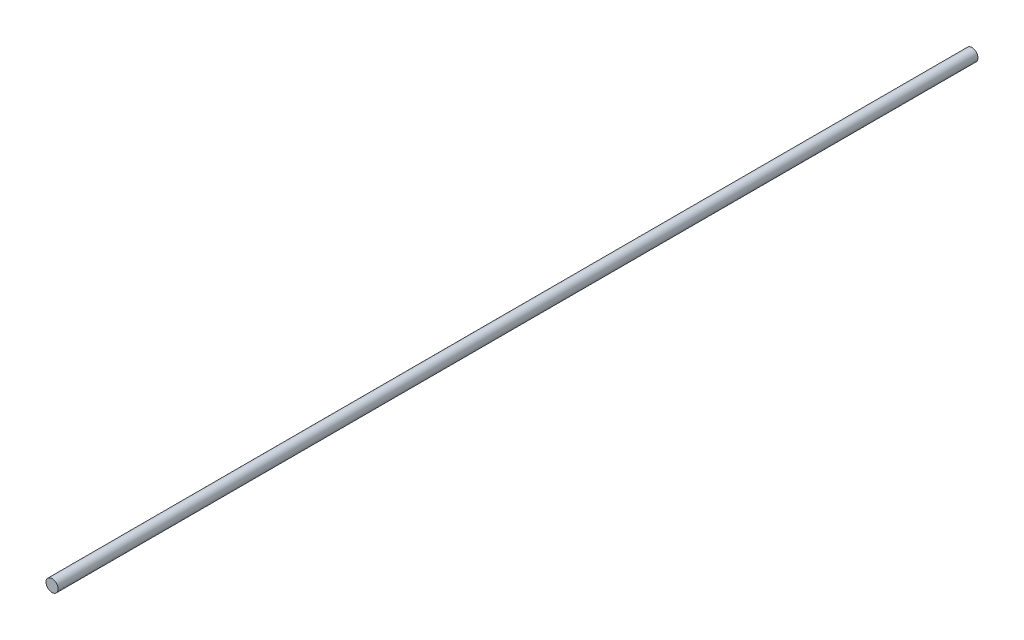
ISO-10303-21;
HEADER;
FILE_DESCRIPTION(('STEP AP214'),'2;1');
FILE_NAME('part.step','',(''),(''),'','','');
FILE_SCHEMA(('AUTOMOTIVE_DESIGN { 1 0 10303 214 1 1 1 1 }'));
ENDSEC;
DATA;
#1=APPLICATION_CONTEXT('core data for automotive mechanical design processes');
#2=APPLICATION_PROTOCOL_DEFINITION('international standard','automotive_design',2000,#1);
#3=PRODUCT_CONTEXT('',#1,'mechanical');
#4=PRODUCT('Part','Part','',(#3));
#5=PRODUCT_RELATED_PRODUCT_CATEGORY('part','',(#4));
#6=PRODUCT_DEFINITION_FORMATION('','',#4);
#7=PRODUCT_DEFINITION_CONTEXT('part definition',#1,'design');
#8=PRODUCT_DEFINITION('design','',#6,#7);
#9=PRODUCT_DEFINITION_SHAPE('','',#8);
#10=(LENGTH_UNIT() NAMED_UNIT(*) SI_UNIT(.MILLI.,.METRE.));
#11=(NAMED_UNIT(*) PLANE_ANGLE_UNIT() SI_UNIT($,.RADIAN.));
#12=(NAMED_UNIT(*) SI_UNIT($,.STERADIAN.) SOLID_ANGLE_UNIT());
#13=UNCERTAINTY_MEASURE_WITH_UNIT(LENGTH_MEASURE(1.E-05),#10,'distance_accuracy_value','');
#14=(GEOMETRIC_REPRESENTATION_CONTEXT(3) GLOBAL_UNCERTAINTY_ASSIGNED_CONTEXT((#13)) GLOBAL_UNIT_ASSIGNED_CONTEXT((#10,
#11,#12)) REPRESENTATION_CONTEXT('',''));
#15=CARTESIAN_POINT('',(0.,0.,0.));
#16=DIRECTION('',(0.,0.,1.));
#17=DIRECTION('',(1.,0.,0.));
#18=AXIS2_PLACEMENT_3D('',#15,#16,#17);
#19=CARTESIAN_POINT('',(0.,0.,609.6));
#20=DIRECTION('',(0.,0.,-1.));
#21=DIRECTION('',(-1.,0.,0.));
#22=AXIS2_PLACEMENT_3D('',#19,#20,#21);
#23=CYLINDRICAL_SURFACE('',#22,4.);
#24=CARTESIAN_POINT('',(0.,0.,609.6));
#25=DIRECTION('',(0.,0.,1.));
#26=DIRECTION('',(1.,0.,0.));
#27=AXIS2_PLACEMENT_3D('',#24,#25,#26);
#28=CIRCLE('',#27,4.);
#29=CARTESIAN_POINT('',(4.,0.,609.6));
#30=VERTEX_POINT('',#29);
#31=EDGE_CURVE('E10',#30,#30,#28,.T.);
#32=ORIENTED_EDGE('',*,*,#31,.F.);
#33=EDGE_LOOP('',(#32));
#34=FACE_BOUND('',#33,.T.);
#35=CARTESIAN_POINT('',(0.,0.,0.));
#36=DIRECTION('',(0.,0.,1.));
#37=DIRECTION('',(1.,0.,0.));
#38=AXIS2_PLACEMENT_3D('',#35,#36,#37);
#39=CIRCLE('',#38,4.);
#40=CARTESIAN_POINT('',(4.,0.,0.));
#41=VERTEX_POINT('',#40);
#42=EDGE_CURVE('E34',#41,#41,#39,.T.);
#43=ORIENTED_EDGE('',*,*,#42,.T.);
#44=EDGE_LOOP('',(#43));
#45=FACE_BOUND('',#44,.T.);
#46=ADVANCED_FACE('F31',(#34,#45),#23,.T.);
#47=CARTESIAN_POINT('',(0.,0.,609.6));
#48=DIRECTION('',(0.,0.,1.));
#49=DIRECTION('',(1.,0.,0.));
#50=AXIS2_PLACEMENT_3D('',#47,#48,#49);
#51=PLANE('',#50);
#52=ORIENTED_EDGE('',*,*,#31,.T.);
#53=EDGE_LOOP('',(#52));
#54=FACE_BOUND('',#53,.T.);
#55=ADVANCED_FACE('F46',(#54),#51,.T.);
#56=CARTESIAN_POINT('',(0.,0.,0.));
#57=DIRECTION('',(0.,0.,1.));
#58=DIRECTION('',(1.,0.,0.));
#59=AXIS2_PLACEMENT_3D('',#56,#57,#58);
#60=PLANE('',#59);
#61=ORIENTED_EDGE('',*,*,#42,.F.);
#62=EDGE_LOOP('',(#61));
#63=FACE_BOUND('',#62,.T.);
#64=ADVANCED_FACE('F44',(#63),#60,.F.);
#65=CLOSED_SHELL('',(#46,#55,#64));
#66=MANIFOLD_SOLID_BREP('B2',#65);
#67=ADVANCED_BREP_SHAPE_REPRESENTATION('',(#18,#66),#14);
#68=SHAPE_DEFINITION_REPRESENTATION(#9,#67);
ENDSEC;
END-ISO-10303-21;
